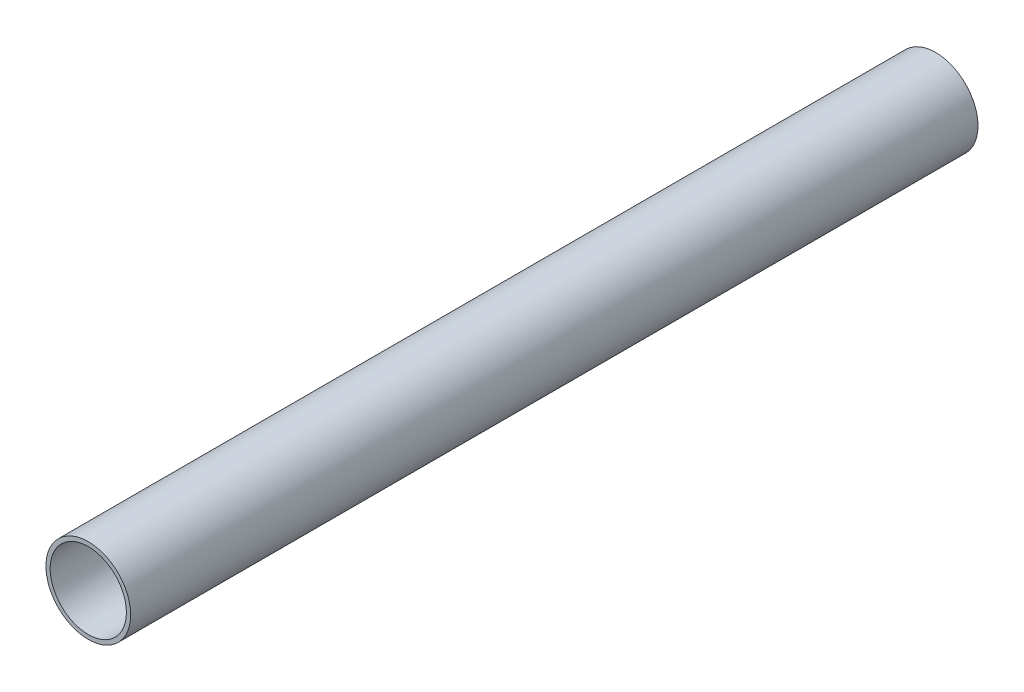
ISO-10303-21;
HEADER;
FILE_DESCRIPTION(('STEP AP214'),'2;1');
FILE_NAME('part.step','',(''),(''),'','','');
FILE_SCHEMA(('AUTOMOTIVE_DESIGN { 1 0 10303 214 1 1 1 1 }'));
ENDSEC;
DATA;
#1=APPLICATION_CONTEXT('core data for automotive mechanical design processes');
#2=APPLICATION_PROTOCOL_DEFINITION('international standard','automotive_design',2000,#1);
#3=PRODUCT_CONTEXT('',#1,'mechanical');
#4=PRODUCT('Part','Part','',(#3));
#5=PRODUCT_RELATED_PRODUCT_CATEGORY('part','',(#4));
#6=PRODUCT_DEFINITION_FORMATION('','',#4);
#7=PRODUCT_DEFINITION_CONTEXT('part definition',#1,'design');
#8=PRODUCT_DEFINITION('design','',#6,#7);
#9=PRODUCT_DEFINITION_SHAPE('','',#8);
#10=(LENGTH_UNIT() NAMED_UNIT(*) SI_UNIT(.MILLI.,.METRE.));
#11=(NAMED_UNIT(*) PLANE_ANGLE_UNIT() SI_UNIT($,.RADIAN.));
#12=(NAMED_UNIT(*) SI_UNIT($,.STERADIAN.) SOLID_ANGLE_UNIT());
#13=UNCERTAINTY_MEASURE_WITH_UNIT(LENGTH_MEASURE(1.E-05),#10,'distance_accuracy_value','');
#14=(GEOMETRIC_REPRESENTATION_CONTEXT(3) GLOBAL_UNCERTAINTY_ASSIGNED_CONTEXT((#13)) GLOBAL_UNIT_ASSIGNED_CONTEXT((#10,
#11,#12)) REPRESENTATION_CONTEXT('',''));
#15=CARTESIAN_POINT('',(0.,0.,0.));
#16=DIRECTION('',(0.,0.,1.));
#17=DIRECTION('',(1.,0.,0.));
#18=AXIS2_PLACEMENT_3D('',#15,#16,#17);
#19=CARTESIAN_POINT('',(0.,0.,200.));
#20=DIRECTION('',(0.,0.,1.));
#21=DIRECTION('',(1.,0.,0.));
#22=AXIS2_PLACEMENT_3D('',#19,#20,#21);
#23=PLANE('',#22);
#24=CARTESIAN_POINT('',(0.,0.,200.));
#25=DIRECTION('',(0.,0.,1.));
#26=DIRECTION('',(1.,0.,0.));
#27=AXIS2_PLACEMENT_3D('',#24,#25,#26);
#28=CIRCLE('',#27,10.);
#29=CARTESIAN_POINT('',(10.,0.,200.));
#30=VERTEX_POINT('',#29);
#31=EDGE_CURVE('E11',#30,#30,#28,.T.);
#32=ORIENTED_EDGE('',*,*,#31,.T.);
#33=EDGE_LOOP('',(#32));
#34=FACE_BOUND('',#33,.T.);
#35=CARTESIAN_POINT('',(0.,0.,200.));
#36=DIRECTION('',(0.,0.,1.));
#37=DIRECTION('',(1.,0.,0.));
#38=AXIS2_PLACEMENT_3D('',#35,#36,#37);
#39=CIRCLE('',#38,9.);
#40=CARTESIAN_POINT('',(9.,0.,200.));
#41=VERTEX_POINT('',#40);
#42=EDGE_CURVE('E51',#41,#41,#39,.T.);
#43=ORIENTED_EDGE('',*,*,#42,.F.);
#44=EDGE_LOOP('',(#43));
#45=FACE_BOUND('',#44,.T.);
#46=ADVANCED_FACE('F40',(#34,#45),#23,.T.);
#47=CARTESIAN_POINT('',(0.,0.,0.));
#48=DIRECTION('',(0.,0.,1.));
#49=DIRECTION('',(1.,0.,0.));
#50=AXIS2_PLACEMENT_3D('',#47,#48,#49);
#51=PLANE('',#50);
#52=CARTESIAN_POINT('',(0.,0.,0.));
#53=DIRECTION('',(0.,0.,1.));
#54=DIRECTION('',(1.,0.,0.));
#55=AXIS2_PLACEMENT_3D('',#52,#53,#54);
#56=CIRCLE('',#55,10.);
#57=CARTESIAN_POINT('',(10.,0.,0.));
#58=VERTEX_POINT('',#57);
#59=EDGE_CURVE('E44',#58,#58,#56,.T.);
#60=ORIENTED_EDGE('',*,*,#59,.F.);
#61=EDGE_LOOP('',(#60));
#62=FACE_BOUND('',#61,.T.);
#63=CARTESIAN_POINT('',(0.,0.,0.));
#64=DIRECTION('',(0.,0.,1.));
#65=DIRECTION('',(1.,0.,0.));
#66=AXIS2_PLACEMENT_3D('',#63,#64,#65);
#67=CIRCLE('',#66,9.);
#68=CARTESIAN_POINT('',(9.,0.,0.));
#69=VERTEX_POINT('',#68);
#70=EDGE_CURVE('E53',#69,#69,#67,.T.);
#71=ORIENTED_EDGE('',*,*,#70,.T.);
#72=EDGE_LOOP('',(#71));
#73=FACE_BOUND('',#72,.T.);
#74=ADVANCED_FACE('F63',(#62,#73),#51,.F.);
#75=CARTESIAN_POINT('',(0.,0.,200.));
#76=DIRECTION('',(0.,0.,-1.));
#77=DIRECTION('',(-1.,0.,0.));
#78=AXIS2_PLACEMENT_3D('',#75,#76,#77);
#79=CYLINDRICAL_SURFACE('',#78,10.);
#80=ORIENTED_EDGE('',*,*,#31,.F.);
#81=EDGE_LOOP('',(#80));
#82=FACE_BOUND('',#81,.T.);
#83=ORIENTED_EDGE('',*,*,#59,.T.);
#84=EDGE_LOOP('',(#83));
#85=FACE_BOUND('',#84,.T.);
#86=ADVANCED_FACE('F42',(#82,#85),#79,.T.);
#87=CARTESIAN_POINT('',(0.,0.,200.));
#88=DIRECTION('',(0.,0.,-1.));
#89=DIRECTION('',(-1.,0.,0.));
#90=AXIS2_PLACEMENT_3D('',#87,#88,#89);
#91=CYLINDRICAL_SURFACE('',#90,9.);
#92=ORIENTED_EDGE('',*,*,#42,.T.);
#93=EDGE_LOOP('',(#92));
#94=FACE_BOUND('',#93,.T.);
#95=ORIENTED_EDGE('',*,*,#70,.F.);
#96=EDGE_LOOP('',(#95));
#97=FACE_BOUND('',#96,.T.);
#98=ADVANCED_FACE('F59',(#94,#97),#91,.F.);
#99=CLOSED_SHELL('',(#46,#74,#86,#98));
#100=MANIFOLD_SOLID_BREP('B2',#99);
#101=ADVANCED_BREP_SHAPE_REPRESENTATION('',(#18,#100),#14);
#102=SHAPE_DEFINITION_REPRESENTATION(#9,#101);
ENDSEC;
END-ISO-10303-21;
